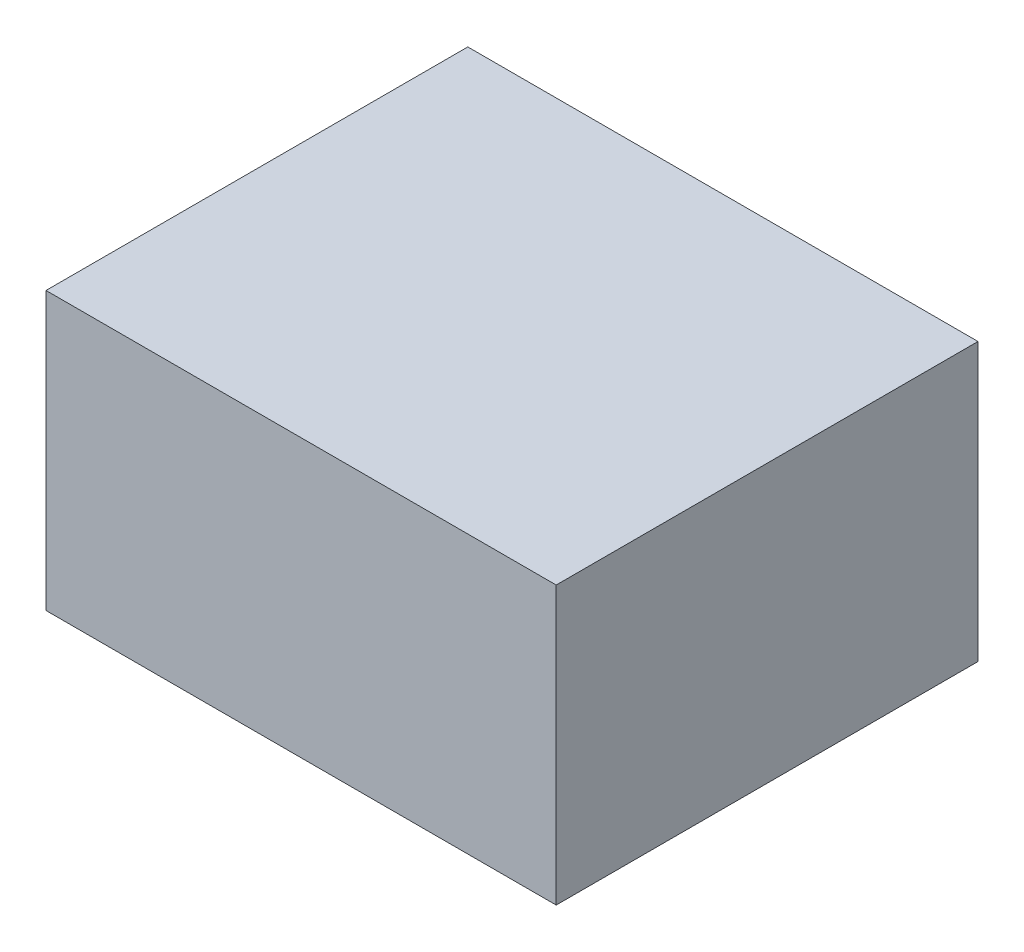
ISO-10303-21;
HEADER;
FILE_DESCRIPTION(('STEP AP214'),'2;1');
FILE_NAME('part.step','',(''),(''),'','','');
FILE_SCHEMA(('AUTOMOTIVE_DESIGN { 1 0 10303 214 1 1 1 1 }'));
ENDSEC;
DATA;
#1=APPLICATION_CONTEXT('core data for automotive mechanical design processes');
#2=APPLICATION_PROTOCOL_DEFINITION('international standard','automotive_design',2000,#1);
#3=PRODUCT_CONTEXT('',#1,'mechanical');
#4=PRODUCT('Part','Part','',(#3));
#5=PRODUCT_RELATED_PRODUCT_CATEGORY('part','',(#4));
#6=PRODUCT_DEFINITION_FORMATION('','',#4);
#7=PRODUCT_DEFINITION_CONTEXT('part definition',#1,'design');
#8=PRODUCT_DEFINITION('design','',#6,#7);
#9=PRODUCT_DEFINITION_SHAPE('','',#8);
#10=(LENGTH_UNIT() NAMED_UNIT(*) SI_UNIT(.MILLI.,.METRE.));
#11=(NAMED_UNIT(*) PLANE_ANGLE_UNIT() SI_UNIT($,.RADIAN.));
#12=(NAMED_UNIT(*) SI_UNIT($,.STERADIAN.) SOLID_ANGLE_UNIT());
#13=UNCERTAINTY_MEASURE_WITH_UNIT(LENGTH_MEASURE(1.E-05),#10,'distance_accuracy_value','');
#14=(GEOMETRIC_REPRESENTATION_CONTEXT(3) GLOBAL_UNCERTAINTY_ASSIGNED_CONTEXT((#13)) GLOBAL_UNIT_ASSIGNED_CONTEXT((#10,
#11,#12)) REPRESENTATION_CONTEXT('',''));
#15=CARTESIAN_POINT('',(0.,0.,0.));
#16=DIRECTION('',(0.,0.,1.));
#17=DIRECTION('',(1.,0.,0.));
#18=AXIS2_PLACEMENT_3D('',#15,#16,#17);
#19=CARTESIAN_POINT('',(0.,0.,0.));
#20=DIRECTION('',(0.,1.,0.));
#21=DIRECTION('',(0.,0.,1.));
#22=AXIS2_PLACEMENT_3D('',#19,#20,#21);
#23=PLANE('',#22);
#24=DIRECTION('',(0.,0.,1.));
#25=VECTOR('',#24,1.);
#26=CARTESIAN_POINT('',(-84.136546184739,0.,-42.8413654618474));
#27=LINE('',#26,#25);
#28=CARTESIAN_POINT('',(-84.136546184739,0.,-42.8413654618474));
#29=VERTEX_POINT('',#28);
#30=CARTESIAN_POINT('',(-84.136546184739,0.,62.1586345381526));
#31=VERTEX_POINT('',#30);
#32=EDGE_CURVE('E109',#29,#31,#27,.T.);
#33=ORIENTED_EDGE('',*,*,#32,.F.);
#34=DIRECTION('',(-1.,0.,0.));
#35=VECTOR('',#34,1.);
#36=CARTESIAN_POINT('',(-84.136546184739,0.,-42.8413654618474));
#37=LINE('',#36,#35);
#38=CARTESIAN_POINT('',(42.863453815261,0.,-42.8413654618474));
#39=VERTEX_POINT('',#38);
#40=EDGE_CURVE('E161',#39,#29,#37,.T.);
#41=ORIENTED_EDGE('',*,*,#40,.F.);
#42=DIRECTION('',(0.,0.,-1.));
#43=VECTOR('',#42,1.);
#44=CARTESIAN_POINT('',(42.863453815261,0.,-42.8413654618474));
#45=LINE('',#44,#43);
#46=CARTESIAN_POINT('',(42.863453815261,0.,62.1586345381526));
#47=VERTEX_POINT('',#46);
#48=EDGE_CURVE('E159',#47,#39,#45,.T.);
#49=ORIENTED_EDGE('',*,*,#48,.F.);
#50=DIRECTION('',(1.,0.,0.));
#51=VECTOR('',#50,1.);
#52=CARTESIAN_POINT('',(-84.136546184739,0.,62.1586345381526));
#53=LINE('',#52,#51);
#54=EDGE_CURVE('E157',#31,#47,#53,.T.);
#55=ORIENTED_EDGE('',*,*,#54,.F.);
#56=EDGE_LOOP('',(#33,#41,#49,#55));
#57=FACE_BOUND('',#56,.T.);
#58=DIRECTION('',(0.,0.,1.));
#59=VECTOR('',#58,1.);
#60=CARTESIAN_POINT('',(-81.636546184739,0.,-40.3413654618474));
#61=LINE('',#60,#59);
#62=CARTESIAN_POINT('',(-81.636546184739,0.,-40.3413654618474));
#63=VERTEX_POINT('',#62);
#64=CARTESIAN_POINT('',(-81.636546184739,0.,59.6586345381526));
#65=VERTEX_POINT('',#64);
#66=EDGE_CURVE('E60',#63,#65,#61,.T.);
#67=ORIENTED_EDGE('',*,*,#66,.T.);
#68=DIRECTION('',(1.,0.,0.));
#69=VECTOR('',#68,1.);
#70=CARTESIAN_POINT('',(-81.636546184739,0.,59.6586345381526));
#71=LINE('',#70,#69);
#72=CARTESIAN_POINT('',(40.363453815261,0.,59.6586345381526));
#73=VERTEX_POINT('',#72);
#74=EDGE_CURVE('E141',#65,#73,#71,.T.);
#75=ORIENTED_EDGE('',*,*,#74,.T.);
#76=DIRECTION('',(0.,0.,-1.));
#77=VECTOR('',#76,1.);
#78=CARTESIAN_POINT('',(40.363453815261,0.,-40.3413654618474));
#79=LINE('',#78,#77);
#80=CARTESIAN_POINT('',(40.363453815261,0.,-40.3413654618474));
#81=VERTEX_POINT('',#80);
#82=EDGE_CURVE('E144',#73,#81,#79,.T.);
#83=ORIENTED_EDGE('',*,*,#82,.T.);
#84=DIRECTION('',(-1.,0.,0.));
#85=VECTOR('',#84,1.);
#86=CARTESIAN_POINT('',(-81.636546184739,0.,-40.3413654618474));
#87=LINE('',#86,#85);
#88=EDGE_CURVE('E132',#81,#63,#87,.T.);
#89=ORIENTED_EDGE('',*,*,#88,.T.);
#90=EDGE_LOOP('',(#67,#75,#83,#89));
#91=FACE_BOUND('',#90,.T.);
#92=ADVANCED_FACE('F37',(#57,#91),#23,.F.);
#93=CARTESIAN_POINT('',(-84.136546184739,66.5,-42.8413654618474));
#94=DIRECTION('',(1.,0.,0.));
#95=DIRECTION('',(0.,0.,-1.));
#96=AXIS2_PLACEMENT_3D('',#93,#94,#95);
#97=PLANE('',#96);
#98=ORIENTED_EDGE('',*,*,#32,.T.);
#99=DIRECTION('',(0.,-1.,0.));
#100=VECTOR('',#99,1.);
#101=CARTESIAN_POINT('',(-84.136546184739,66.5,62.1586345381526));
#102=LINE('',#101,#100);
#103=CARTESIAN_POINT('',(-84.136546184739,69.,62.1586345381526));
#104=VERTEX_POINT('',#103);
#105=EDGE_CURVE('E11',#104,#31,#102,.T.);
#106=ORIENTED_EDGE('',*,*,#105,.F.);
#107=DIRECTION('',(0.,0.,1.));
#108=VECTOR('',#107,1.);
#109=CARTESIAN_POINT('',(-84.136546184739,69.,62.1586345381526));
#110=LINE('',#109,#108);
#111=CARTESIAN_POINT('',(-84.136546184739,69.,-42.8413654618474));
#112=VERTEX_POINT('',#111);
#113=EDGE_CURVE('E107',#112,#104,#110,.T.);
#114=ORIENTED_EDGE('',*,*,#113,.F.);
#115=DIRECTION('',(0.,-1.,0.));
#116=VECTOR('',#115,1.);
#117=CARTESIAN_POINT('',(-84.136546184739,66.5,-42.8413654618474));
#118=LINE('',#117,#116);
#119=EDGE_CURVE('E163',#112,#29,#118,.T.);
#120=ORIENTED_EDGE('',*,*,#119,.T.);
#121=EDGE_LOOP('',(#98,#106,#114,#120));
#122=FACE_BOUND('',#121,.T.);
#123=ADVANCED_FACE('F39',(#122),#97,.F.);
#124=CARTESIAN_POINT('',(-84.136546184739,66.5,62.1586345381526));
#125=DIRECTION('',(0.,0.,-1.));
#126=DIRECTION('',(-1.,0.,0.));
#127=AXIS2_PLACEMENT_3D('',#124,#125,#126);
#128=PLANE('',#127);
#129=ORIENTED_EDGE('',*,*,#54,.T.);
#130=DIRECTION('',(0.,-1.,0.));
#131=VECTOR('',#130,1.);
#132=CARTESIAN_POINT('',(42.863453815261,66.5,62.1586345381526));
#133=LINE('',#132,#131);
#134=CARTESIAN_POINT('',(42.863453815261,69.,62.1586345381526));
#135=VERTEX_POINT('',#134);
#136=EDGE_CURVE('E45',#135,#47,#133,.T.);
#137=ORIENTED_EDGE('',*,*,#136,.F.);
#138=DIRECTION('',(1.,0.,0.));
#139=VECTOR('',#138,1.);
#140=CARTESIAN_POINT('',(-84.136546184739,69.,62.1586345381526));
#141=LINE('',#140,#139);
#142=EDGE_CURVE('E112',#104,#135,#141,.T.);
#143=ORIENTED_EDGE('',*,*,#142,.F.);
#144=ORIENTED_EDGE('',*,*,#105,.T.);
#145=EDGE_LOOP('',(#129,#137,#143,#144));
#146=FACE_BOUND('',#145,.T.);
#147=ADVANCED_FACE('F113',(#146),#128,.F.);
#148=CARTESIAN_POINT('',(42.863453815261,66.5,-42.8413654618474));
#149=DIRECTION('',(-1.,0.,0.));
#150=DIRECTION('',(0.,0.,1.));
#151=AXIS2_PLACEMENT_3D('',#148,#149,#150);
#152=PLANE('',#151);
#153=ORIENTED_EDGE('',*,*,#48,.T.);
#154=DIRECTION('',(0.,-1.,0.));
#155=VECTOR('',#154,1.);
#156=CARTESIAN_POINT('',(42.863453815261,66.5,-42.8413654618474));
#157=LINE('',#156,#155);
#158=CARTESIAN_POINT('',(42.863453815261,69.,-42.8413654618474));
#159=VERTEX_POINT('',#158);
#160=EDGE_CURVE('E165',#159,#39,#157,.T.);
#161=ORIENTED_EDGE('',*,*,#160,.F.);
#162=DIRECTION('',(0.,0.,-1.));
#163=VECTOR('',#162,1.);
#164=CARTESIAN_POINT('',(42.863453815261,69.,62.1586345381526));
#165=LINE('',#164,#163);
#166=EDGE_CURVE('E118',#135,#159,#165,.T.);
#167=ORIENTED_EDGE('',*,*,#166,.F.);
#168=ORIENTED_EDGE('',*,*,#136,.T.);
#169=EDGE_LOOP('',(#153,#161,#167,#168));
#170=FACE_BOUND('',#169,.T.);
#171=ADVANCED_FACE('F169',(#170),#152,.F.);
#172=CARTESIAN_POINT('',(-84.136546184739,66.5,-42.8413654618474));
#173=DIRECTION('',(0.,0.,1.));
#174=DIRECTION('',(1.,0.,0.));
#175=AXIS2_PLACEMENT_3D('',#172,#173,#174);
#176=PLANE('',#175);
#177=ORIENTED_EDGE('',*,*,#40,.T.);
#178=ORIENTED_EDGE('',*,*,#119,.F.);
#179=DIRECTION('',(-1.,0.,0.));
#180=VECTOR('',#179,1.);
#181=CARTESIAN_POINT('',(-84.136546184739,69.,-42.8413654618474));
#182=LINE('',#181,#180);
#183=EDGE_CURVE('E123',#159,#112,#182,.T.);
#184=ORIENTED_EDGE('',*,*,#183,.F.);
#185=ORIENTED_EDGE('',*,*,#160,.T.);
#186=EDGE_LOOP('',(#177,#178,#184,#185));
#187=FACE_BOUND('',#186,.T.);
#188=ADVANCED_FACE('F174',(#187),#176,.F.);
#189=CARTESIAN_POINT('',(-81.636546184739,66.5,-40.3413654618474));
#190=DIRECTION('',(1.,0.,0.));
#191=DIRECTION('',(0.,0.,-1.));
#192=AXIS2_PLACEMENT_3D('',#189,#190,#191);
#193=PLANE('',#192);
#194=ORIENTED_EDGE('',*,*,#66,.F.);
#195=DIRECTION('',(0.,-1.,0.));
#196=VECTOR('',#195,1.);
#197=CARTESIAN_POINT('',(-81.636546184739,66.5,-40.3413654618474));
#198=LINE('',#197,#196);
#199=CARTESIAN_POINT('',(-81.636546184739,66.5,-40.3413654618474));
#200=VERTEX_POINT('',#199);
#201=EDGE_CURVE('E139',#200,#63,#198,.T.);
#202=ORIENTED_EDGE('',*,*,#201,.F.);
#203=DIRECTION('',(0.,0.,1.));
#204=VECTOR('',#203,1.);
#205=CARTESIAN_POINT('',(-81.636546184739,66.5,-40.3413654618474));
#206=LINE('',#205,#204);
#207=CARTESIAN_POINT('',(-81.636546184739,66.5,59.6586345381526));
#208=VERTEX_POINT('',#207);
#209=EDGE_CURVE('E128',#200,#208,#206,.T.);
#210=ORIENTED_EDGE('',*,*,#209,.T.);
#211=DIRECTION('',(0.,-1.,0.));
#212=VECTOR('',#211,1.);
#213=CARTESIAN_POINT('',(-81.636546184739,66.5,59.6586345381526));
#214=LINE('',#213,#212);
#215=EDGE_CURVE('E154',#208,#65,#214,.T.);
#216=ORIENTED_EDGE('',*,*,#215,.T.);
#217=EDGE_LOOP('',(#194,#202,#210,#216));
#218=FACE_BOUND('',#217,.T.);
#219=ADVANCED_FACE('F176',(#218),#193,.T.);
#220=CARTESIAN_POINT('',(-81.636546184739,66.5,59.6586345381526));
#221=DIRECTION('',(0.,0.,-1.));
#222=DIRECTION('',(-1.,0.,0.));
#223=AXIS2_PLACEMENT_3D('',#220,#221,#222);
#224=PLANE('',#223);
#225=ORIENTED_EDGE('',*,*,#74,.F.);
#226=ORIENTED_EDGE('',*,*,#215,.F.);
#227=DIRECTION('',(1.,0.,0.));
#228=VECTOR('',#227,1.);
#229=CARTESIAN_POINT('',(-81.636546184739,66.5,59.6586345381526));
#230=LINE('',#229,#228);
#231=CARTESIAN_POINT('',(40.363453815261,66.5,59.6586345381526));
#232=VERTEX_POINT('',#231);
#233=EDGE_CURVE('E131',#208,#232,#230,.T.);
#234=ORIENTED_EDGE('',*,*,#233,.T.);
#235=DIRECTION('',(0.,-1.,0.));
#236=VECTOR('',#235,1.);
#237=CARTESIAN_POINT('',(40.363453815261,66.5,59.6586345381526));
#238=LINE('',#237,#236);
#239=EDGE_CURVE('E152',#232,#73,#238,.T.);
#240=ORIENTED_EDGE('',*,*,#239,.T.);
#241=EDGE_LOOP('',(#225,#226,#234,#240));
#242=FACE_BOUND('',#241,.T.);
#243=ADVANCED_FACE('F182',(#242),#224,.T.);
#244=CARTESIAN_POINT('',(40.363453815261,66.5,-40.3413654618474));
#245=DIRECTION('',(-1.,0.,0.));
#246=DIRECTION('',(0.,0.,1.));
#247=AXIS2_PLACEMENT_3D('',#244,#245,#246);
#248=PLANE('',#247);
#249=ORIENTED_EDGE('',*,*,#82,.F.);
#250=ORIENTED_EDGE('',*,*,#239,.F.);
#251=DIRECTION('',(0.,0.,-1.));
#252=VECTOR('',#251,1.);
#253=CARTESIAN_POINT('',(40.363453815261,66.5,-40.3413654618474));
#254=LINE('',#253,#252);
#255=CARTESIAN_POINT('',(40.363453815261,66.5,-40.3413654618474));
#256=VERTEX_POINT('',#255);
#257=EDGE_CURVE('E135',#232,#256,#254,.T.);
#258=ORIENTED_EDGE('',*,*,#257,.T.);
#259=DIRECTION('',(0.,-1.,0.));
#260=VECTOR('',#259,1.);
#261=CARTESIAN_POINT('',(40.363453815261,66.5,-40.3413654618474));
#262=LINE('',#261,#260);
#263=EDGE_CURVE('E150',#256,#81,#262,.T.);
#264=ORIENTED_EDGE('',*,*,#263,.T.);
#265=EDGE_LOOP('',(#249,#250,#258,#264));
#266=FACE_BOUND('',#265,.T.);
#267=ADVANCED_FACE('F193',(#266),#248,.T.);
#268=CARTESIAN_POINT('',(-81.636546184739,66.5,-40.3413654618474));
#269=DIRECTION('',(0.,0.,1.));
#270=DIRECTION('',(1.,0.,0.));
#271=AXIS2_PLACEMENT_3D('',#268,#269,#270);
#272=PLANE('',#271);
#273=ORIENTED_EDGE('',*,*,#88,.F.);
#274=ORIENTED_EDGE('',*,*,#263,.F.);
#275=DIRECTION('',(-1.,0.,0.));
#276=VECTOR('',#275,1.);
#277=CARTESIAN_POINT('',(-81.636546184739,66.5,-40.3413654618474));
#278=LINE('',#277,#276);
#279=EDGE_CURVE('E52',#256,#200,#278,.T.);
#280=ORIENTED_EDGE('',*,*,#279,.T.);
#281=ORIENTED_EDGE('',*,*,#201,.T.);
#282=EDGE_LOOP('',(#273,#274,#280,#281));
#283=FACE_BOUND('',#282,.T.);
#284=ADVANCED_FACE('F197',(#283),#272,.T.);
#285=CARTESIAN_POINT('',(0.,66.5,0.));
#286=DIRECTION('',(0.,-1.,0.));
#287=DIRECTION('',(0.,0.,-1.));
#288=AXIS2_PLACEMENT_3D('',#285,#286,#287);
#289=PLANE('',#288);
#290=ORIENTED_EDGE('',*,*,#233,.F.);
#291=ORIENTED_EDGE('',*,*,#209,.F.);
#292=ORIENTED_EDGE('',*,*,#279,.F.);
#293=ORIENTED_EDGE('',*,*,#257,.F.);
#294=EDGE_LOOP('',(#290,#291,#292,#293));
#295=FACE_BOUND('',#294,.T.);
#296=ADVANCED_FACE('F201',(#295),#289,.T.);
#297=CARTESIAN_POINT('',(0.,69.,0.));
#298=DIRECTION('',(0.,-1.,0.));
#299=DIRECTION('',(0.,0.,-1.));
#300=AXIS2_PLACEMENT_3D('',#297,#298,#299);
#301=PLANE('',#300);
#302=ORIENTED_EDGE('',*,*,#113,.T.);
#303=ORIENTED_EDGE('',*,*,#142,.T.);
#304=ORIENTED_EDGE('',*,*,#166,.T.);
#305=ORIENTED_EDGE('',*,*,#183,.T.);
#306=EDGE_LOOP('',(#302,#303,#304,#305));
#307=FACE_BOUND('',#306,.T.);
#308=ADVANCED_FACE('F121',(#307),#301,.F.);
#309=CLOSED_SHELL('',(#92,#123,#147,#171,#188,#219,#243,#267,#284,#296,#308));
#310=MANIFOLD_SOLID_BREP('B2',#309);
#311=ADVANCED_BREP_SHAPE_REPRESENTATION('',(#18,#310),#14);
#312=SHAPE_DEFINITION_REPRESENTATION(#9,#311);
ENDSEC;
END-ISO-10303-21;
